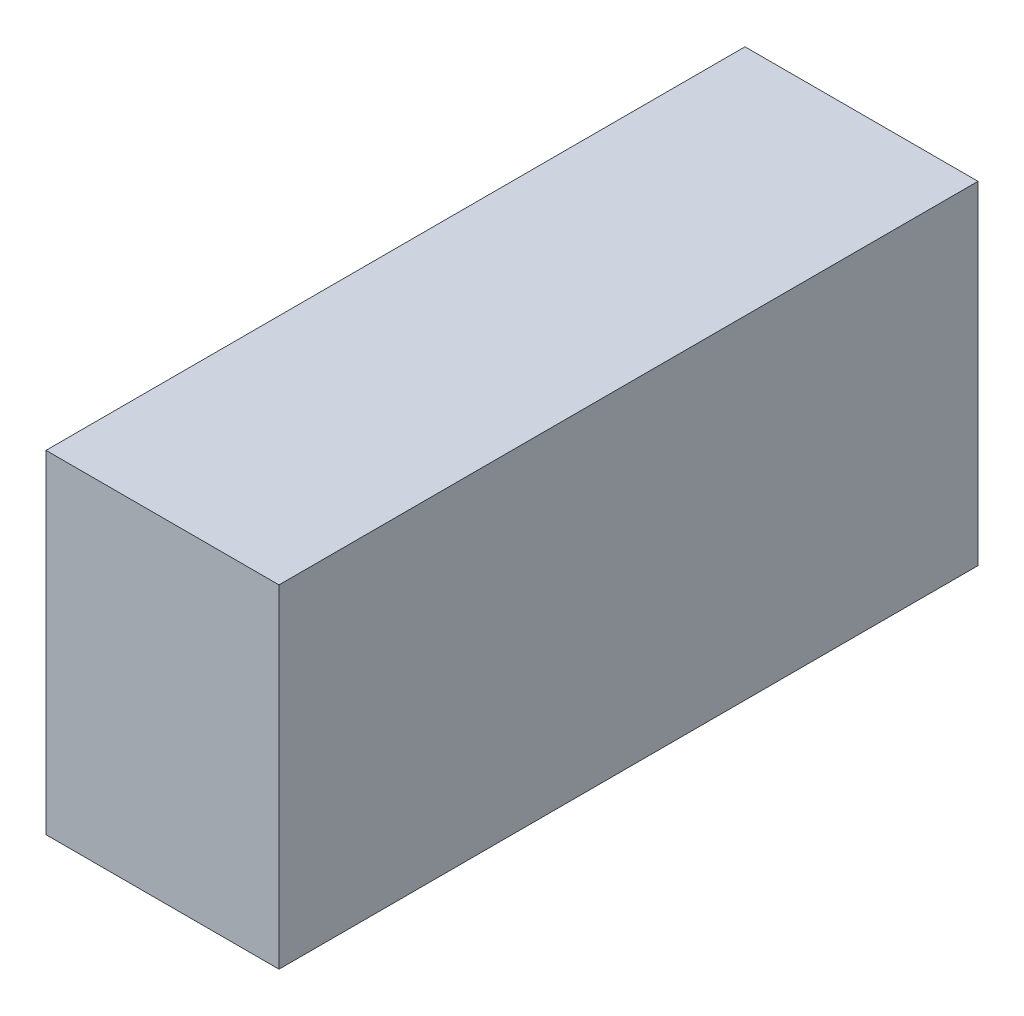
ISO-10303-21;
HEADER;
FILE_DESCRIPTION(('STEP AP214'),'2;1');
FILE_NAME('part.step','',(''),(''),'','','');
FILE_SCHEMA(('AUTOMOTIVE_DESIGN { 1 0 10303 214 1 1 1 1 }'));
ENDSEC;
DATA;
#1=APPLICATION_CONTEXT('core data for automotive mechanical design processes');
#2=APPLICATION_PROTOCOL_DEFINITION('international standard','automotive_design',2000,#1);
#3=PRODUCT_CONTEXT('',#1,'mechanical');
#4=PRODUCT('Part','Part','',(#3));
#5=PRODUCT_RELATED_PRODUCT_CATEGORY('part','',(#4));
#6=PRODUCT_DEFINITION_FORMATION('','',#4);
#7=PRODUCT_DEFINITION_CONTEXT('part definition',#1,'design');
#8=PRODUCT_DEFINITION('design','',#6,#7);
#9=PRODUCT_DEFINITION_SHAPE('','',#8);
#10=(LENGTH_UNIT() NAMED_UNIT(*) SI_UNIT(.MILLI.,.METRE.));
#11=(NAMED_UNIT(*) PLANE_ANGLE_UNIT() SI_UNIT($,.RADIAN.));
#12=(NAMED_UNIT(*) SI_UNIT($,.STERADIAN.) SOLID_ANGLE_UNIT());
#13=UNCERTAINTY_MEASURE_WITH_UNIT(LENGTH_MEASURE(1.E-05),#10,'distance_accuracy_value','');
#14=(GEOMETRIC_REPRESENTATION_CONTEXT(3) GLOBAL_UNCERTAINTY_ASSIGNED_CONTEXT((#13)) GLOBAL_UNIT_ASSIGNED_CONTEXT((#10,
#11,#12)) REPRESENTATION_CONTEXT('',''));
#15=CARTESIAN_POINT('',(0.,0.,0.));
#16=DIRECTION('',(0.,0.,1.));
#17=DIRECTION('',(1.,0.,0.));
#18=AXIS2_PLACEMENT_3D('',#15,#16,#17);
#19=CARTESIAN_POINT('',(0.,31.75,0.));
#20=DIRECTION('',(1.,0.,0.));
#21=DIRECTION('',(0.,0.,-1.));
#22=AXIS2_PLACEMENT_3D('',#19,#20,#21);
#23=PLANE('',#22);
#24=DIRECTION('',(0.,0.,1.));
#25=VECTOR('',#24,1.);
#26=CARTESIAN_POINT('',(0.,0.,0.));
#27=LINE('',#26,#25);
#28=CARTESIAN_POINT('',(0.,0.,-66.675));
#29=VERTEX_POINT('',#28);
#30=CARTESIAN_POINT('',(0.,0.,0.));
#31=VERTEX_POINT('',#30);
#32=EDGE_CURVE('E100',#29,#31,#27,.T.);
#33=ORIENTED_EDGE('',*,*,#32,.T.);
#34=DIRECTION('',(0.,-1.,0.));
#35=VECTOR('',#34,1.);
#36=CARTESIAN_POINT('',(0.,31.75,0.));
#37=LINE('',#36,#35);
#38=CARTESIAN_POINT('',(0.,31.75,0.));
#39=VERTEX_POINT('',#38);
#40=EDGE_CURVE('E11',#39,#31,#37,.T.);
#41=ORIENTED_EDGE('',*,*,#40,.F.);
#42=DIRECTION('',(0.,0.,1.));
#43=VECTOR('',#42,1.);
#44=CARTESIAN_POINT('',(0.,31.75,0.));
#45=LINE('',#44,#43);
#46=CARTESIAN_POINT('',(0.,31.75,-66.675));
#47=VERTEX_POINT('',#46);
#48=EDGE_CURVE('E88',#47,#39,#45,.T.);
#49=ORIENTED_EDGE('',*,*,#48,.F.);
#50=DIRECTION('',(0.,-1.,0.));
#51=VECTOR('',#50,1.);
#52=CARTESIAN_POINT('',(0.,31.75,-66.675));
#53=LINE('',#52,#51);
#54=EDGE_CURVE('E96',#47,#29,#53,.T.);
#55=ORIENTED_EDGE('',*,*,#54,.T.);
#56=EDGE_LOOP('',(#33,#41,#49,#55));
#57=FACE_BOUND('',#56,.T.);
#58=ADVANCED_FACE('F37',(#57),#23,.F.);
#59=CARTESIAN_POINT('',(0.,31.75,0.));
#60=DIRECTION('',(0.,0.,-1.));
#61=DIRECTION('',(-1.,0.,0.));
#62=AXIS2_PLACEMENT_3D('',#59,#60,#61);
#63=PLANE('',#62);
#64=DIRECTION('',(1.,0.,0.));
#65=VECTOR('',#64,1.);
#66=CARTESIAN_POINT('',(0.,0.,0.));
#67=LINE('',#66,#65);
#68=CARTESIAN_POINT('',(22.225,0.,0.));
#69=VERTEX_POINT('',#68);
#70=EDGE_CURVE('E92',#31,#69,#67,.T.);
#71=ORIENTED_EDGE('',*,*,#70,.T.);
#72=DIRECTION('',(0.,-1.,0.));
#73=VECTOR('',#72,1.);
#74=CARTESIAN_POINT('',(22.225,31.75,0.));
#75=LINE('',#74,#73);
#76=CARTESIAN_POINT('',(22.225,31.75,0.));
#77=VERTEX_POINT('',#76);
#78=EDGE_CURVE('E45',#77,#69,#75,.T.);
#79=ORIENTED_EDGE('',*,*,#78,.F.);
#80=DIRECTION('',(1.,0.,0.));
#81=VECTOR('',#80,1.);
#82=CARTESIAN_POINT('',(0.,31.75,0.));
#83=LINE('',#82,#81);
#84=EDGE_CURVE('E83',#39,#77,#83,.T.);
#85=ORIENTED_EDGE('',*,*,#84,.F.);
#86=ORIENTED_EDGE('',*,*,#40,.T.);
#87=EDGE_LOOP('',(#71,#79,#85,#86));
#88=FACE_BOUND('',#87,.T.);
#89=ADVANCED_FACE('F91',(#88),#63,.F.);
#90=CARTESIAN_POINT('',(22.225,31.75,0.));
#91=DIRECTION('',(-1.,0.,0.));
#92=DIRECTION('',(0.,0.,1.));
#93=AXIS2_PLACEMENT_3D('',#90,#91,#92);
#94=PLANE('',#93);
#95=DIRECTION('',(0.,0.,-1.));
#96=VECTOR('',#95,1.);
#97=CARTESIAN_POINT('',(22.225,0.,0.));
#98=LINE('',#97,#96);
#99=CARTESIAN_POINT('',(22.225,0.,-66.675));
#100=VERTEX_POINT('',#99);
#101=EDGE_CURVE('E70',#69,#100,#98,.T.);
#102=ORIENTED_EDGE('',*,*,#101,.T.);
#103=DIRECTION('',(0.,-1.,0.));
#104=VECTOR('',#103,1.);
#105=CARTESIAN_POINT('',(22.225,31.75,-66.675));
#106=LINE('',#105,#104);
#107=CARTESIAN_POINT('',(22.225,31.75,-66.675));
#108=VERTEX_POINT('',#107);
#109=EDGE_CURVE('E93',#108,#100,#106,.T.);
#110=ORIENTED_EDGE('',*,*,#109,.F.);
#111=DIRECTION('',(0.,0.,-1.));
#112=VECTOR('',#111,1.);
#113=CARTESIAN_POINT('',(22.225,31.75,0.));
#114=LINE('',#113,#112);
#115=EDGE_CURVE('E86',#77,#108,#114,.T.);
#116=ORIENTED_EDGE('',*,*,#115,.F.);
#117=ORIENTED_EDGE('',*,*,#78,.T.);
#118=EDGE_LOOP('',(#102,#110,#116,#117));
#119=FACE_BOUND('',#118,.T.);
#120=ADVANCED_FACE('F94',(#119),#94,.F.);
#121=CARTESIAN_POINT('',(0.,31.75,-66.675));
#122=DIRECTION('',(0.,0.,1.));
#123=DIRECTION('',(1.,0.,0.));
#124=AXIS2_PLACEMENT_3D('',#121,#122,#123);
#125=PLANE('',#124);
#126=DIRECTION('',(-1.,0.,0.));
#127=VECTOR('',#126,1.);
#128=CARTESIAN_POINT('',(0.,0.,-66.675));
#129=LINE('',#128,#127);
#130=EDGE_CURVE('E76',#100,#29,#129,.T.);
#131=ORIENTED_EDGE('',*,*,#130,.T.);
#132=ORIENTED_EDGE('',*,*,#54,.F.);
#133=DIRECTION('',(-1.,0.,0.));
#134=VECTOR('',#133,1.);
#135=CARTESIAN_POINT('',(0.,31.75,-66.675));
#136=LINE('',#135,#134);
#137=EDGE_CURVE('E53',#108,#47,#136,.T.);
#138=ORIENTED_EDGE('',*,*,#137,.F.);
#139=ORIENTED_EDGE('',*,*,#109,.T.);
#140=EDGE_LOOP('',(#131,#132,#138,#139));
#141=FACE_BOUND('',#140,.T.);
#142=ADVANCED_FACE('F107',(#141),#125,.F.);
#143=CARTESIAN_POINT('',(0.,31.75,0.));
#144=DIRECTION('',(0.,-1.,0.));
#145=DIRECTION('',(0.,0.,-1.));
#146=AXIS2_PLACEMENT_3D('',#143,#144,#145);
#147=PLANE('',#146);
#148=ORIENTED_EDGE('',*,*,#48,.T.);
#149=ORIENTED_EDGE('',*,*,#84,.T.);
#150=ORIENTED_EDGE('',*,*,#115,.T.);
#151=ORIENTED_EDGE('',*,*,#137,.T.);
#152=EDGE_LOOP('',(#148,#149,#150,#151));
#153=FACE_BOUND('',#152,.T.);
#154=ADVANCED_FACE('F84',(#153),#147,.F.);
#155=CARTESIAN_POINT('',(0.,0.,0.));
#156=DIRECTION('',(0.,-1.,0.));
#157=DIRECTION('',(0.,0.,-1.));
#158=AXIS2_PLACEMENT_3D('',#155,#156,#157);
#159=PLANE('',#158);
#160=ORIENTED_EDGE('',*,*,#32,.F.);
#161=ORIENTED_EDGE('',*,*,#130,.F.);
#162=ORIENTED_EDGE('',*,*,#101,.F.);
#163=ORIENTED_EDGE('',*,*,#70,.F.);
#164=EDGE_LOOP('',(#160,#161,#162,#163));
#165=FACE_BOUND('',#164,.T.);
#166=ADVANCED_FACE('F110',(#165),#159,.T.);
#167=CLOSED_SHELL('',(#58,#89,#120,#142,#154,#166));
#168=MANIFOLD_SOLID_BREP('B2',#167);
#169=ADVANCED_BREP_SHAPE_REPRESENTATION('',(#18,#168),#14);
#170=SHAPE_DEFINITION_REPRESENTATION(#9,#169);
ENDSEC;
END-ISO-10303-21;
